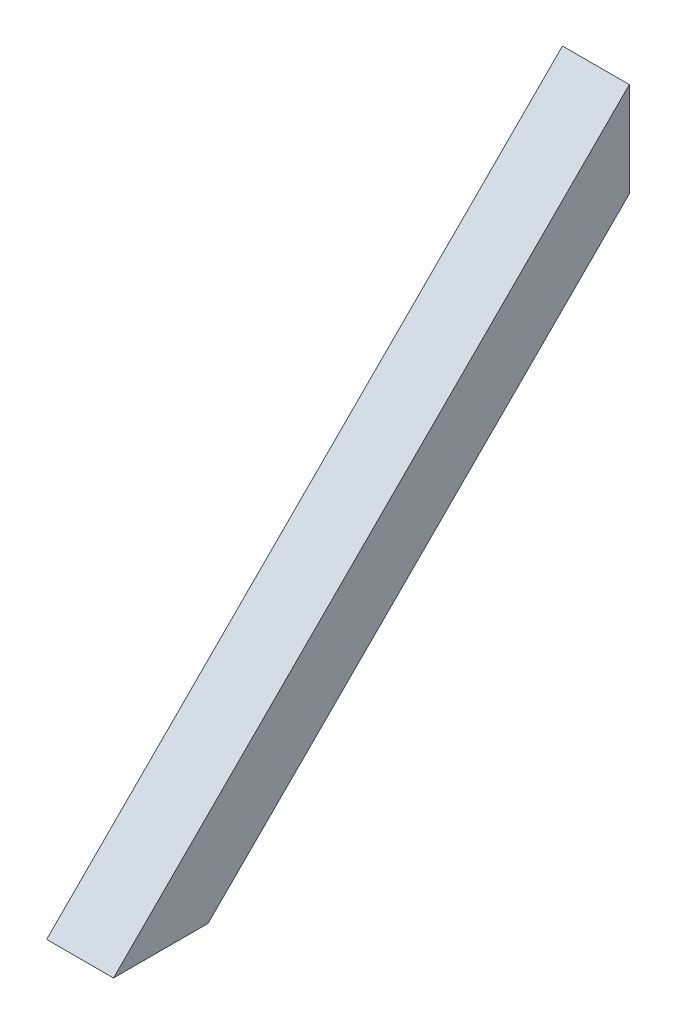
ISO-10303-21;
HEADER;
FILE_DESCRIPTION(('STEP AP214'),'2;1');
FILE_NAME('part.step','',(''),(''),'','','');
FILE_SCHEMA(('AUTOMOTIVE_DESIGN { 1 0 10303 214 1 1 1 1 }'));
ENDSEC;
DATA;
#1=APPLICATION_CONTEXT('core data for automotive mechanical design processes');
#2=APPLICATION_PROTOCOL_DEFINITION('international standard','automotive_design',2000,#1);
#3=PRODUCT_CONTEXT('',#1,'mechanical');
#4=PRODUCT('Part','Part','',(#3));
#5=PRODUCT_RELATED_PRODUCT_CATEGORY('part','',(#4));
#6=PRODUCT_DEFINITION_FORMATION('','',#4);
#7=PRODUCT_DEFINITION_CONTEXT('part definition',#1,'design');
#8=PRODUCT_DEFINITION('design','',#6,#7);
#9=PRODUCT_DEFINITION_SHAPE('','',#8);
#10=(LENGTH_UNIT() NAMED_UNIT(*) SI_UNIT(.MILLI.,.METRE.));
#11=(NAMED_UNIT(*) PLANE_ANGLE_UNIT() SI_UNIT($,.RADIAN.));
#12=(NAMED_UNIT(*) SI_UNIT($,.STERADIAN.) SOLID_ANGLE_UNIT());
#13=UNCERTAINTY_MEASURE_WITH_UNIT(LENGTH_MEASURE(1.E-05),#10,'distance_accuracy_value','');
#14=(GEOMETRIC_REPRESENTATION_CONTEXT(3) GLOBAL_UNCERTAINTY_ASSIGNED_CONTEXT((#13)) GLOBAL_UNIT_ASSIGNED_CONTEXT((#10,
#11,#12)) REPRESENTATION_CONTEXT('',''));
#15=CARTESIAN_POINT('',(0.,0.,0.));
#16=DIRECTION('',(0.,0.,1.));
#17=DIRECTION('',(1.,0.,0.));
#18=AXIS2_PLACEMENT_3D('',#15,#16,#17);
#19=CARTESIAN_POINT('',(-565.149999999998,644.844103576249,-295.274999999998));
#20=DIRECTION('',(0.,0.,-0.999999999999995));
#21=DIRECTION('',(0.,0.999999999999995,0.));
#22=AXIS2_PLACEMENT_3D('',#19,#20,#21);
#23=PLANE('',#22);
#24=DIRECTION('',(0.999999999999995,0.,0.));
#25=VECTOR('',#24,1.);
#26=CARTESIAN_POINT('',(-565.149999999997,614.728335213043,-295.274999999997));
#27=LINE('',#26,#25);
#28=CARTESIAN_POINT('',(-568.324999999995,614.728335213043,-295.274999999997));
#29=VERTEX_POINT('',#28);
#30=CARTESIAN_POINT('',(-606.424999999995,614.728335213043,-295.274999999998));
#31=VERTEX_POINT('',#30);
#32=EDGE_CURVE('E104',#29,#31,#27,.F.);
#33=ORIENTED_EDGE('',*,*,#32,.F.);
#34=DIRECTION('',(0.,0.999999999999995,0.));
#35=VECTOR('',#34,1.);
#36=CARTESIAN_POINT('',(-568.324999999995,327.024999999998,-295.274999999998));
#37=LINE('',#36,#35);
#38=CARTESIAN_POINT('',(-568.324999999995,668.609871939458,-295.275));
#39=VERTEX_POINT('',#38);
#40=EDGE_CURVE('E94',#39,#29,#37,.F.);
#41=ORIENTED_EDGE('',*,*,#40,.F.);
#42=DIRECTION('',(0.999999999999995,0.,0.));
#43=VECTOR('',#42,1.);
#44=CARTESIAN_POINT('',(-565.149999999997,668.609871939457,-295.274999999998));
#45=LINE('',#44,#43);
#46=CARTESIAN_POINT('',(-606.424999999995,668.609871939458,-295.274999999997));
#47=VERTEX_POINT('',#46);
#48=EDGE_CURVE('E77',#47,#39,#45,.T.);
#49=ORIENTED_EDGE('',*,*,#48,.F.);
#50=DIRECTION('',(0.,0.999999999999995,0.));
#51=VECTOR('',#50,1.);
#52=CARTESIAN_POINT('',(-606.424999999995,327.024999999996,-295.274999999998));
#53=LINE('',#52,#51);
#54=EDGE_CURVE('E17',#47,#31,#53,.F.);
#55=ORIENTED_EDGE('',*,*,#54,.T.);
#56=EDGE_LOOP('',(#33,#41,#49,#55));
#57=FACE_BOUND('',#56,.T.);
#58=ADVANCED_FACE('F14',(#57),#23,.F.);
#59=CARTESIAN_POINT('',(-606.424999999998,327.024999999996,-126.999999999998));
#60=DIRECTION('',(-0.999999999999995,0.,0.));
#61=DIRECTION('',(0.,0.,0.999999999999995));
#62=AXIS2_PLACEMENT_3D('',#59,#60,#61);
#63=PLANE('',#62);
#64=DIRECTION('',(0.,-0.707106781186543,0.70710678118654));
#65=VECTOR('',#64,1.);
#66=CARTESIAN_POINT('',(-606.424999999996,409.936467461109,-90.4831322480594));
#67=LINE('',#66,#65);
#68=CARTESIAN_POINT('',(-606.424999999995,333.374999999995,-13.9216647869486));
#69=VERTEX_POINT('',#68);
#70=EDGE_CURVE('E87',#31,#69,#67,.T.);
#71=ORIENTED_EDGE('',*,*,#70,.F.);
#72=ORIENTED_EDGE('',*,*,#54,.F.);
#73=DIRECTION('',(0.,0.707106781186543,-0.70710678118654));
#74=VECTOR('',#73,1.);
#75=CARTESIAN_POINT('',(-606.425,435.733989646212,-62.3991177067487));
#76=LINE('',#75,#74);
#77=CARTESIAN_POINT('',(-606.424999999993,333.374999999997,39.959871939466));
#78=VERTEX_POINT('',#77);
#79=EDGE_CURVE('E85',#78,#47,#76,.T.);
#80=ORIENTED_EDGE('',*,*,#79,.F.);
#81=DIRECTION('',(0.,0.,-0.999999999999995));
#82=VECTOR('',#81,1.);
#83=CARTESIAN_POINT('',(-606.424999999995,333.374999999997,25.4000000000009));
#84=LINE('',#83,#82);
#85=EDGE_CURVE('E114',#69,#78,#84,.F.);
#86=ORIENTED_EDGE('',*,*,#85,.F.);
#87=EDGE_LOOP('',(#71,#72,#80,#86));
#88=FACE_BOUND('',#87,.T.);
#89=ADVANCED_FACE('F83',(#88),#63,.F.);
#90=CARTESIAN_POINT('',(-565.15,435.733989646212,-62.3991177067487));
#91=DIRECTION('',(0.,-0.707106781186542,-0.707106781186543));
#92=DIRECTION('',(0.,0.707106781186543,-0.70710678118654));
#93=AXIS2_PLACEMENT_3D('',#90,#91,#92);
#94=PLANE('',#93);
#95=DIRECTION('',(0.,0.707106781186543,-0.70710678118654));
#96=VECTOR('',#95,1.);
#97=CARTESIAN_POINT('',(-568.324999999995,333.374999999998,39.9598719394665));
#98=LINE('',#97,#96);
#99=CARTESIAN_POINT('',(-568.324999999995,333.374999999998,39.9598719394665));
#100=VERTEX_POINT('',#99);
#101=EDGE_CURVE('E95',#100,#39,#98,.T.);
#102=ORIENTED_EDGE('',*,*,#101,.F.);
#103=DIRECTION('',(0.999999999999995,0.,0.));
#104=VECTOR('',#103,1.);
#105=CARTESIAN_POINT('',(-565.149999999995,333.374999999997,39.9598719394659));
#106=LINE('',#105,#104);
#107=EDGE_CURVE('E92',#78,#100,#106,.T.);
#108=ORIENTED_EDGE('',*,*,#107,.F.);
#109=ORIENTED_EDGE('',*,*,#79,.T.);
#110=ORIENTED_EDGE('',*,*,#48,.T.);
#111=EDGE_LOOP('',(#102,#108,#109,#110));
#112=FACE_BOUND('',#111,.T.);
#113=ADVANCED_FACE('F91',(#112),#94,.T.);
#114=CARTESIAN_POINT('',(-568.324999999998,327.024999999996,-126.999999999999));
#115=DIRECTION('',(-0.999999999999995,0.,0.));
#116=DIRECTION('',(0.,0.,0.999999999999995));
#117=AXIS2_PLACEMENT_3D('',#114,#115,#116);
#118=PLANE('',#117);
#119=ORIENTED_EDGE('',*,*,#40,.T.);
#120=DIRECTION('',(0.,-0.707106781186543,0.70710678118654));
#121=VECTOR('',#120,1.);
#122=CARTESIAN_POINT('',(-568.324999999996,409.936467461107,-90.4831322480595));
#123=LINE('',#122,#121);
#124=CARTESIAN_POINT('',(-568.324999999995,333.374999999996,-13.9216647869477));
#125=VERTEX_POINT('',#124);
#126=EDGE_CURVE('E101',#125,#29,#123,.F.);
#127=ORIENTED_EDGE('',*,*,#126,.F.);
#128=DIRECTION('',(0.,0.,-0.999999999999995));
#129=VECTOR('',#128,1.);
#130=CARTESIAN_POINT('',(-568.324999999998,333.374999999998,25.4000000000013));
#131=LINE('',#130,#129);
#132=EDGE_CURVE('E117',#100,#125,#131,.T.);
#133=ORIENTED_EDGE('',*,*,#132,.F.);
#134=ORIENTED_EDGE('',*,*,#101,.T.);
#135=EDGE_LOOP('',(#119,#127,#133,#134));
#136=FACE_BOUND('',#135,.T.);
#137=ADVANCED_FACE('F176',(#136),#118,.T.);
#138=CARTESIAN_POINT('',(-565.150000000001,409.936467461107,-90.4831322480595));
#139=DIRECTION('',(0.,0.707106781186542,0.707106781186543));
#140=DIRECTION('',(0.,-0.707106781186543,0.70710678118654));
#141=AXIS2_PLACEMENT_3D('',#138,#139,#140);
#142=PLANE('',#141);
#143=ORIENTED_EDGE('',*,*,#126,.T.);
#144=ORIENTED_EDGE('',*,*,#32,.T.);
#145=ORIENTED_EDGE('',*,*,#70,.T.);
#146=DIRECTION('',(0.999999999999995,0.,0.));
#147=VECTOR('',#146,1.);
#148=CARTESIAN_POINT('',(-565.149999999995,333.374999999995,-13.9216647869483));
#149=LINE('',#148,#147);
#150=EDGE_CURVE('E119',#125,#69,#149,.F.);
#151=ORIENTED_EDGE('',*,*,#150,.F.);
#152=EDGE_LOOP('',(#143,#144,#145,#151));
#153=FACE_BOUND('',#152,.T.);
#154=ADVANCED_FACE('F172',(#153),#142,.T.);
#155=CARTESIAN_POINT('',(-565.15,407.69140343084,-92.7281962783267));
#156=DIRECTION('',(0.,0.707106781186542,0.707106781186543));
#157=DIRECTION('',(0.,-0.707106781186543,0.70710678118654));
#158=AXIS2_PLACEMENT_3D('',#155,#156,#157);
#159=PLANE('',#158);
#160=DIRECTION('',(0.999999999999995,0.,0.));
#161=VECTOR('',#160,1.);
#162=CARTESIAN_POINT('',(-565.15,613.41320715251,-298.449999999998));
#163=LINE('',#162,#161);
#164=CARTESIAN_POINT('',(-565.15,613.41320715251,-298.449999999997));
#165=VERTEX_POINT('',#164);
#166=CARTESIAN_POINT('',(-609.599999999998,613.413207152508,-298.449999999998));
#167=VERTEX_POINT('',#166);
#168=EDGE_CURVE('E106',#165,#167,#163,.F.);
#169=ORIENTED_EDGE('',*,*,#168,.F.);
#170=DIRECTION('',(0.,-0.707106781186543,0.70710678118654));
#171=VECTOR('',#170,1.);
#172=CARTESIAN_POINT('',(-565.15,613.41320715251,-298.449999999998));
#173=LINE('',#172,#171);
#174=CARTESIAN_POINT('',(-565.149999999994,333.374999999996,-18.4117928474827));
#175=VERTEX_POINT('',#174);
#176=EDGE_CURVE('E111',#165,#175,#173,.T.);
#177=ORIENTED_EDGE('',*,*,#176,.T.);
#178=DIRECTION('',(0.999999999999995,0.,0.));
#179=VECTOR('',#178,1.);
#180=CARTESIAN_POINT('',(-565.149999999994,333.374999999996,-18.4117928474828));
#181=LINE('',#180,#179);
#182=CARTESIAN_POINT('',(-609.599999999995,333.374999999996,-18.4117928474831));
#183=VERTEX_POINT('',#182);
#184=EDGE_CURVE('E122',#183,#175,#181,.T.);
#185=ORIENTED_EDGE('',*,*,#184,.F.);
#186=DIRECTION('',(0.,-0.707106781186543,0.70710678118654));
#187=VECTOR('',#186,1.);
#188=CARTESIAN_POINT('',(-609.599999999998,613.413207152508,-298.449999999998));
#189=LINE('',#188,#187);
#190=EDGE_CURVE('E130',#167,#183,#189,.T.);
#191=ORIENTED_EDGE('',*,*,#190,.F.);
#192=EDGE_LOOP('',(#169,#177,#185,#191));
#193=FACE_BOUND('',#192,.T.);
#194=ADVANCED_FACE('F169',(#193),#159,.F.);
#195=CARTESIAN_POINT('',(-565.15,644.844103576252,-298.449999999997));
#196=DIRECTION('',(0.,0.,-0.999999999999995));
#197=DIRECTION('',(0.,0.999999999999995,0.));
#198=AXIS2_PLACEMENT_3D('',#195,#196,#197);
#199=PLANE('',#198);
#200=DIRECTION('',(0.,0.999999999999995,0.));
#201=VECTOR('',#200,1.);
#202=CARTESIAN_POINT('',(-565.149999999998,327.024999999998,-298.449999999998));
#203=LINE('',#202,#201);
#204=CARTESIAN_POINT('',(-565.15,676.274999999994,-298.449999999999));
#205=VERTEX_POINT('',#204);
#206=EDGE_CURVE('E108',#205,#165,#203,.F.);
#207=ORIENTED_EDGE('',*,*,#206,.T.);
#208=ORIENTED_EDGE('',*,*,#168,.T.);
#209=DIRECTION('',(0.,0.999999999999995,0.));
#210=VECTOR('',#209,1.);
#211=CARTESIAN_POINT('',(-609.599999999996,327.024999999998,-298.449999999998));
#212=LINE('',#211,#210);
#213=CARTESIAN_POINT('',(-609.599999999998,676.274999999992,-298.449999999998));
#214=VERTEX_POINT('',#213);
#215=EDGE_CURVE('E127',#214,#167,#212,.F.);
#216=ORIENTED_EDGE('',*,*,#215,.F.);
#217=DIRECTION('',(0.999999999999995,0.,0.));
#218=VECTOR('',#217,1.);
#219=CARTESIAN_POINT('',(-565.15,676.274999999994,-298.449999999999));
#220=LINE('',#219,#218);
#221=EDGE_CURVE('E132',#214,#205,#220,.T.);
#222=ORIENTED_EDGE('',*,*,#221,.T.);
#223=EDGE_LOOP('',(#207,#208,#216,#222));
#224=FACE_BOUND('',#223,.T.);
#225=ADVANCED_FACE('F151',(#224),#199,.T.);
#226=CARTESIAN_POINT('',(-565.149999999998,327.024999999996,-126.999999999998));
#227=DIRECTION('',(-0.999999999999995,0.,0.));
#228=DIRECTION('',(0.,0.,0.999999999999995));
#229=AXIS2_PLACEMENT_3D('',#226,#227,#228);
#230=PLANE('',#229);
#231=ORIENTED_EDGE('',*,*,#176,.F.);
#232=ORIENTED_EDGE('',*,*,#206,.F.);
#233=DIRECTION('',(0.,0.707106781186543,-0.70710678118654));
#234=VECTOR('',#233,1.);
#235=CARTESIAN_POINT('',(-565.15,437.979053676479,-60.1540536764816));
#236=LINE('',#235,#234);
#237=CARTESIAN_POINT('',(-565.149999999995,333.374999999997,44.4500000000005));
#238=VERTEX_POINT('',#237);
#239=EDGE_CURVE('E135',#205,#238,#236,.F.);
#240=ORIENTED_EDGE('',*,*,#239,.T.);
#241=DIRECTION('',(0.,0.,-0.999999999999995));
#242=VECTOR('',#241,1.);
#243=CARTESIAN_POINT('',(-565.149999999995,333.374999999997,25.4000000000009));
#244=LINE('',#243,#242);
#245=EDGE_CURVE('E124',#175,#238,#244,.F.);
#246=ORIENTED_EDGE('',*,*,#245,.F.);
#247=EDGE_LOOP('',(#231,#232,#240,#246));
#248=FACE_BOUND('',#247,.T.);
#249=ADVANCED_FACE('F149',(#248),#230,.F.);
#250=CARTESIAN_POINT('',(-565.149999999995,333.374999999997,25.4000000000009));
#251=DIRECTION('',(0.,-0.999999999999995,0.));
#252=DIRECTION('',(0.,0.,-0.999999999999995));
#253=AXIS2_PLACEMENT_3D('',#250,#251,#252);
#254=PLANE('',#253);
#255=ORIENTED_EDGE('',*,*,#245,.T.);
#256=DIRECTION('',(0.999999999999995,0.,0.));
#257=VECTOR('',#256,1.);
#258=CARTESIAN_POINT('',(-565.149999999995,333.374999999997,44.4500000000004));
#259=LINE('',#258,#257);
#260=CARTESIAN_POINT('',(-609.599999999995,333.374999999998,44.4500000000005));
#261=VERTEX_POINT('',#260);
#262=EDGE_CURVE('E23',#238,#261,#259,.F.);
#263=ORIENTED_EDGE('',*,*,#262,.T.);
#264=DIRECTION('',(0.,0.,0.999999999999995));
#265=VECTOR('',#264,1.);
#266=CARTESIAN_POINT('',(-609.599999999995,333.374999999997,-126.999999999999));
#267=LINE('',#266,#265);
#268=EDGE_CURVE('E31',#183,#261,#267,.T.);
#269=ORIENTED_EDGE('',*,*,#268,.F.);
#270=ORIENTED_EDGE('',*,*,#184,.T.);
#271=EDGE_LOOP('',(#255,#263,#269,#270));
#272=FACE_BOUND('',#271,.T.);
#273=ORIENTED_EDGE('',*,*,#132,.T.);
#274=ORIENTED_EDGE('',*,*,#150,.T.);
#275=ORIENTED_EDGE('',*,*,#85,.T.);
#276=ORIENTED_EDGE('',*,*,#107,.T.);
#277=EDGE_LOOP('',(#273,#274,#275,#276));
#278=FACE_BOUND('',#277,.T.);
#279=ADVANCED_FACE('F141',(#272,#278),#254,.T.);
#280=CARTESIAN_POINT('',(-609.599999999995,327.024999999997,-126.999999999998));
#281=DIRECTION('',(-0.999999999999995,0.,0.));
#282=DIRECTION('',(0.,0.,0.999999999999995));
#283=AXIS2_PLACEMENT_3D('',#280,#281,#282);
#284=PLANE('',#283);
#285=ORIENTED_EDGE('',*,*,#215,.T.);
#286=ORIENTED_EDGE('',*,*,#190,.T.);
#287=ORIENTED_EDGE('',*,*,#268,.T.);
#288=DIRECTION('',(0.,0.707106781186543,-0.70710678118654));
#289=VECTOR('',#288,1.);
#290=CARTESIAN_POINT('',(-609.599999999998,437.979053676479,-60.1540536764819));
#291=LINE('',#290,#289);
#292=EDGE_CURVE('E9',#261,#214,#291,.T.);
#293=ORIENTED_EDGE('',*,*,#292,.T.);
#294=EDGE_LOOP('',(#285,#286,#287,#293));
#295=FACE_BOUND('',#294,.T.);
#296=ADVANCED_FACE('F154',(#295),#284,.T.);
#297=CARTESIAN_POINT('',(-565.15,437.979053676479,-60.1540536764816));
#298=DIRECTION('',(0.,-0.707106781186542,-0.707106781186543));
#299=DIRECTION('',(0.,0.707106781186543,-0.70710678118654));
#300=AXIS2_PLACEMENT_3D('',#297,#298,#299);
#301=PLANE('',#300);
#302=ORIENTED_EDGE('',*,*,#262,.F.);
#303=ORIENTED_EDGE('',*,*,#239,.F.);
#304=ORIENTED_EDGE('',*,*,#221,.F.);
#305=ORIENTED_EDGE('',*,*,#292,.F.);
#306=EDGE_LOOP('',(#302,#303,#304,#305));
#307=FACE_BOUND('',#306,.T.);
#308=ADVANCED_FACE('F146',(#307),#301,.F.);
#309=CLOSED_SHELL('',(#58,#89,#113,#137,#154,#194,#225,#249,#279,#296,#308));
#310=MANIFOLD_SOLID_BREP('B1',#309);
#311=ADVANCED_BREP_SHAPE_REPRESENTATION('',(#18,#310),#14);
#312=SHAPE_DEFINITION_REPRESENTATION(#9,#311);
ENDSEC;
END-ISO-10303-21;
